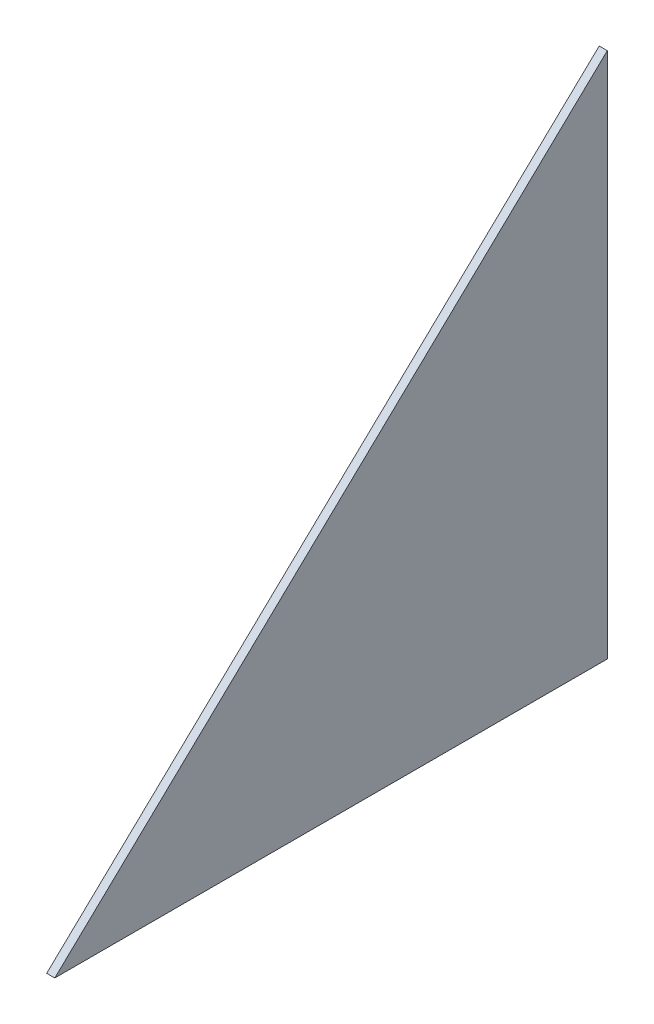
ISO-10303-21;
HEADER;
FILE_DESCRIPTION(('STEP AP214'),'2;1');
FILE_NAME('part.step','',(''),(''),'','','');
FILE_SCHEMA(('AUTOMOTIVE_DESIGN { 1 0 10303 214 1 1 1 1 }'));
ENDSEC;
DATA;
#1=APPLICATION_CONTEXT('core data for automotive mechanical design processes');
#2=APPLICATION_PROTOCOL_DEFINITION('international standard','automotive_design',2000,#1);
#3=PRODUCT_CONTEXT('',#1,'mechanical');
#4=PRODUCT('Part','Part','',(#3));
#5=PRODUCT_RELATED_PRODUCT_CATEGORY('part','',(#4));
#6=PRODUCT_DEFINITION_FORMATION('','',#4);
#7=PRODUCT_DEFINITION_CONTEXT('part definition',#1,'design');
#8=PRODUCT_DEFINITION('design','',#6,#7);
#9=PRODUCT_DEFINITION_SHAPE('','',#8);
#10=(LENGTH_UNIT() NAMED_UNIT(*) SI_UNIT(.MILLI.,.METRE.));
#11=(NAMED_UNIT(*) PLANE_ANGLE_UNIT() SI_UNIT($,.RADIAN.));
#12=(NAMED_UNIT(*) SI_UNIT($,.STERADIAN.) SOLID_ANGLE_UNIT());
#13=UNCERTAINTY_MEASURE_WITH_UNIT(LENGTH_MEASURE(1.E-05),#10,'distance_accuracy_value','');
#14=(GEOMETRIC_REPRESENTATION_CONTEXT(3) GLOBAL_UNCERTAINTY_ASSIGNED_CONTEXT((#13)) GLOBAL_UNIT_ASSIGNED_CONTEXT((#10,
#11,#12)) REPRESENTATION_CONTEXT('',''));
#15=CARTESIAN_POINT('',(0.,0.,0.));
#16=DIRECTION('',(0.,0.,1.));
#17=DIRECTION('',(1.,0.,0.));
#18=AXIS2_PLACEMENT_3D('',#15,#16,#17);
#19=CARTESIAN_POINT('',(-2.,130.,0.));
#20=DIRECTION('',(0.,0.,-1.));
#21=DIRECTION('',(-1.,0.,0.));
#22=AXIS2_PLACEMENT_3D('',#19,#20,#21);
#23=PLANE('',#22);
#24=DIRECTION('',(0.,1.,0.));
#25=VECTOR('',#24,1.);
#26=CARTESIAN_POINT('',(0.,130.,0.));
#27=LINE('',#26,#25);
#28=CARTESIAN_POINT('',(0.,0.,0.));
#29=VERTEX_POINT('',#28);
#30=CARTESIAN_POINT('',(0.,130.,0.));
#31=VERTEX_POINT('',#30);
#32=EDGE_CURVE('E107',#29,#31,#27,.T.);
#33=ORIENTED_EDGE('',*,*,#32,.F.);
#34=DIRECTION('',(1.,0.,0.));
#35=VECTOR('',#34,1.);
#36=CARTESIAN_POINT('',(-2.,0.,0.));
#37=LINE('',#36,#35);
#38=CARTESIAN_POINT('',(-2.,0.,0.));
#39=VERTEX_POINT('',#38);
#40=EDGE_CURVE('E11',#39,#29,#37,.T.);
#41=ORIENTED_EDGE('',*,*,#40,.F.);
#42=DIRECTION('',(0.,1.,0.));
#43=VECTOR('',#42,1.);
#44=CARTESIAN_POINT('',(-2.,130.,0.));
#45=LINE('',#44,#43);
#46=CARTESIAN_POINT('',(-2.,130.,0.));
#47=VERTEX_POINT('',#46);
#48=EDGE_CURVE('E94',#39,#47,#45,.T.);
#49=ORIENTED_EDGE('',*,*,#48,.T.);
#50=DIRECTION('',(1.,0.,0.));
#51=VECTOR('',#50,1.);
#52=CARTESIAN_POINT('',(-2.,130.,0.));
#53=LINE('',#52,#51);
#54=EDGE_CURVE('E48',#47,#31,#53,.T.);
#55=ORIENTED_EDGE('',*,*,#54,.T.);
#56=EDGE_LOOP('',(#33,#41,#49,#55));
#57=FACE_BOUND('',#56,.T.);
#58=ADVANCED_FACE('F45',(#57),#23,.T.);
#59=CARTESIAN_POINT('',(-2.,0.,0.));
#60=DIRECTION('',(0.,-1.,0.));
#61=DIRECTION('',(0.,0.,-1.));
#62=AXIS2_PLACEMENT_3D('',#59,#60,#61);
#63=PLANE('',#62);
#64=DIRECTION('',(0.,0.,-1.));
#65=VECTOR('',#64,1.);
#66=CARTESIAN_POINT('',(0.,0.,0.));
#67=LINE('',#66,#65);
#68=CARTESIAN_POINT('',(0.,0.,136.354385139378));
#69=VERTEX_POINT('',#68);
#70=EDGE_CURVE('E98',#69,#29,#67,.T.);
#71=ORIENTED_EDGE('',*,*,#70,.F.);
#72=DIRECTION('',(1.,0.,0.));
#73=VECTOR('',#72,1.);
#74=CARTESIAN_POINT('',(-2.,0.,136.354385139378));
#75=LINE('',#74,#73);
#76=CARTESIAN_POINT('',(-2.,0.,136.354385139378));
#77=VERTEX_POINT('',#76);
#78=EDGE_CURVE('E55',#77,#69,#75,.T.);
#79=ORIENTED_EDGE('',*,*,#78,.F.);
#80=DIRECTION('',(0.,0.,-1.));
#81=VECTOR('',#80,1.);
#82=CARTESIAN_POINT('',(-2.,0.,0.));
#83=LINE('',#82,#81);
#84=EDGE_CURVE('E91',#77,#39,#83,.T.);
#85=ORIENTED_EDGE('',*,*,#84,.T.);
#86=ORIENTED_EDGE('',*,*,#40,.T.);
#87=EDGE_LOOP('',(#71,#79,#85,#86));
#88=FACE_BOUND('',#87,.T.);
#89=ADVANCED_FACE('F113',(#88),#63,.T.);
#90=CARTESIAN_POINT('',(-2.,0.,136.354385139378));
#91=DIRECTION('',(0.,0.723770206329791,0.690041077349263));
#92=DIRECTION('',(0.,-0.690041077349263,0.723770206329791));
#93=AXIS2_PLACEMENT_3D('',#90,#91,#92);
#94=PLANE('',#93);
#95=DIRECTION('',(0.,-0.690041077349263,0.723770206329791));
#96=VECTOR('',#95,1.);
#97=CARTESIAN_POINT('',(0.,0.,136.354385139378));
#98=LINE('',#97,#96);
#99=EDGE_CURVE('E89',#31,#69,#98,.T.);
#100=ORIENTED_EDGE('',*,*,#99,.F.);
#101=ORIENTED_EDGE('',*,*,#54,.F.);
#102=DIRECTION('',(0.,-0.690041077349263,0.723770206329791));
#103=VECTOR('',#102,1.);
#104=CARTESIAN_POINT('',(-2.,0.,136.354385139378));
#105=LINE('',#104,#103);
#106=EDGE_CURVE('E87',#47,#77,#105,.T.);
#107=ORIENTED_EDGE('',*,*,#106,.T.);
#108=ORIENTED_EDGE('',*,*,#78,.T.);
#109=EDGE_LOOP('',(#100,#101,#107,#108));
#110=FACE_BOUND('',#109,.T.);
#111=ADVANCED_FACE('F86',(#110),#94,.T.);
#112=CARTESIAN_POINT('',(-2.,0.,0.));
#113=DIRECTION('',(-1.,0.,0.));
#114=DIRECTION('',(0.,0.,1.));
#115=AXIS2_PLACEMENT_3D('',#112,#113,#114);
#116=PLANE('',#115);
#117=ORIENTED_EDGE('',*,*,#48,.F.);
#118=ORIENTED_EDGE('',*,*,#84,.F.);
#119=ORIENTED_EDGE('',*,*,#106,.F.);
#120=EDGE_LOOP('',(#117,#118,#119));
#121=FACE_BOUND('',#120,.T.);
#122=ADVANCED_FACE('F93',(#121),#116,.T.);
#123=CARTESIAN_POINT('',(0.,0.,0.));
#124=DIRECTION('',(-1.,0.,0.));
#125=DIRECTION('',(0.,0.,1.));
#126=AXIS2_PLACEMENT_3D('',#123,#124,#125);
#127=PLANE('',#126);
#128=ORIENTED_EDGE('',*,*,#32,.T.);
#129=ORIENTED_EDGE('',*,*,#99,.T.);
#130=ORIENTED_EDGE('',*,*,#70,.T.);
#131=EDGE_LOOP('',(#128,#129,#130));
#132=FACE_BOUND('',#131,.T.);
#133=ADVANCED_FACE('F112',(#132),#127,.F.);
#134=CLOSED_SHELL('',(#58,#89,#111,#122,#133));
#135=MANIFOLD_SOLID_BREP('B2',#134);
#136=ADVANCED_BREP_SHAPE_REPRESENTATION('',(#18,#135),#14);
#137=SHAPE_DEFINITION_REPRESENTATION(#9,#136);
ENDSEC;
END-ISO-10303-21;
